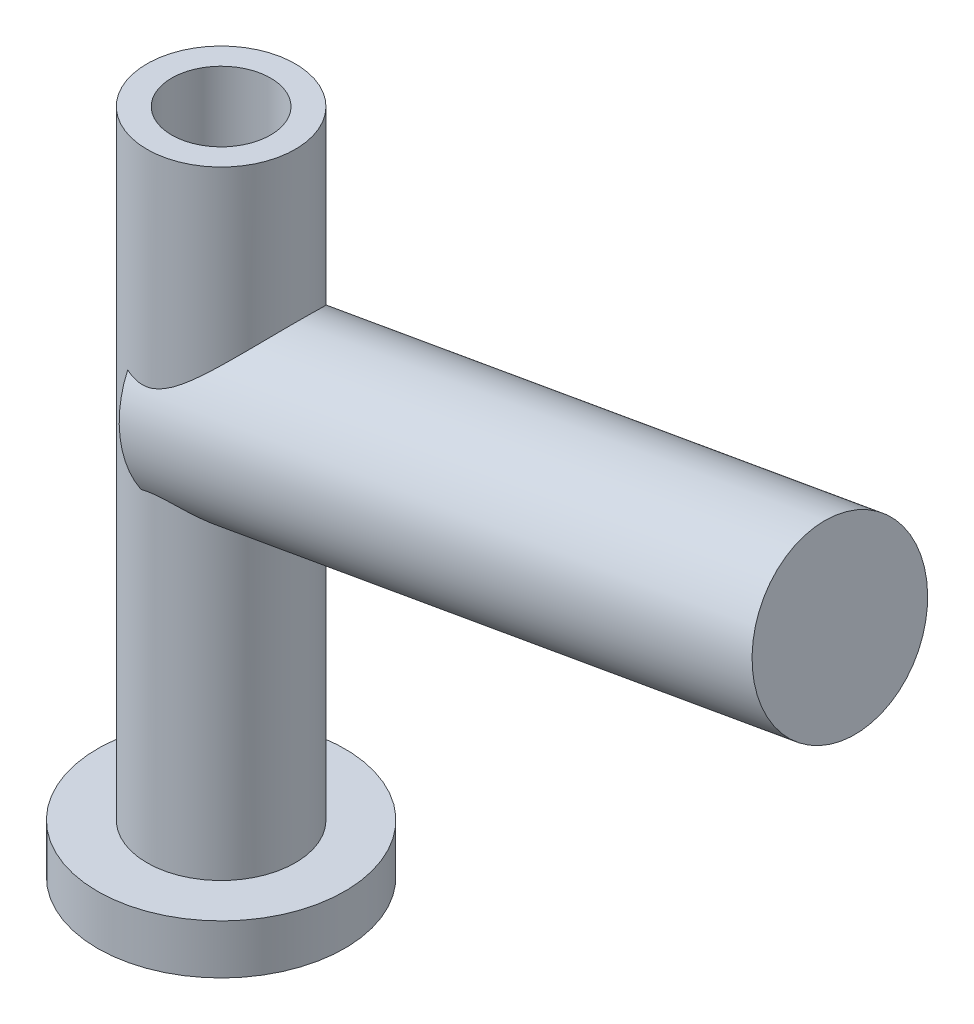
ISO-10303-21;
HEADER;
FILE_DESCRIPTION(('STEP AP214'),'2;1');
FILE_NAME('part.step','',(''),(''),'','','');
FILE_SCHEMA(('AUTOMOTIVE_DESIGN { 1 0 10303 214 1 1 1 1 }'));
ENDSEC;
DATA;
#1=APPLICATION_CONTEXT('core data for automotive mechanical design processes');
#2=APPLICATION_PROTOCOL_DEFINITION('international standard','automotive_design',2000,#1);
#3=PRODUCT_CONTEXT('',#1,'mechanical');
#4=PRODUCT('Part','Part','',(#3));
#5=PRODUCT_RELATED_PRODUCT_CATEGORY('part','',(#4));
#6=PRODUCT_DEFINITION_FORMATION('','',#4);
#7=PRODUCT_DEFINITION_CONTEXT('part definition',#1,'design');
#8=PRODUCT_DEFINITION('design','',#6,#7);
#9=PRODUCT_DEFINITION_SHAPE('','',#8);
#10=(LENGTH_UNIT() NAMED_UNIT(*) SI_UNIT(.MILLI.,.METRE.));
#11=(NAMED_UNIT(*) PLANE_ANGLE_UNIT() SI_UNIT($,.RADIAN.));
#12=(NAMED_UNIT(*) SI_UNIT($,.STERADIAN.) SOLID_ANGLE_UNIT());
#13=UNCERTAINTY_MEASURE_WITH_UNIT(LENGTH_MEASURE(1.E-05),#10,'distance_accuracy_value','');
#14=(GEOMETRIC_REPRESENTATION_CONTEXT(3) GLOBAL_UNCERTAINTY_ASSIGNED_CONTEXT((#13)) GLOBAL_UNIT_ASSIGNED_CONTEXT((#10,
#11,#12)) REPRESENTATION_CONTEXT('',''));
#15=CARTESIAN_POINT('',(0.,0.,0.));
#16=DIRECTION('',(0.,0.,1.));
#17=DIRECTION('',(1.,0.,0.));
#18=AXIS2_PLACEMENT_3D('',#15,#16,#17);
#19=CARTESIAN_POINT('',(0.,135.,0.));
#20=DIRECTION('',(0.,1.,0.));
#21=DIRECTION('',(0.,0.,1.));
#22=AXIS2_PLACEMENT_3D('',#19,#20,#21);
#23=CYLINDRICAL_SURFACE('',#22,30.);
#24=CARTESIAN_POINT('',(0.,-115.,0.));
#25=DIRECTION('',(0.,1.,0.));
#26=DIRECTION('',(0.,0.,1.));
#27=AXIS2_PLACEMENT_3D('',#24,#25,#26);
#28=CIRCLE('',#27,30.);
#29=CARTESIAN_POINT('',(0.,-115.,30.));
#30=VERTEX_POINT('',#29);
#31=EDGE_CURVE('E91',#30,#30,#28,.T.);
#32=ORIENTED_EDGE('',*,*,#31,.T.);
#33=EDGE_LOOP('',(#32));
#34=FACE_BOUND('',#33,.T.);
#35=CARTESIAN_POINT('',(0.,135.,0.));
#36=DIRECTION('',(0.,1.,0.));
#37=DIRECTION('',(0.,0.,1.));
#38=AXIS2_PLACEMENT_3D('',#35,#36,#37);
#39=CIRCLE('',#38,30.);
#40=CARTESIAN_POINT('',(0.,135.,30.));
#41=VERTEX_POINT('',#40);
#42=EDGE_CURVE('E88',#41,#41,#39,.T.);
#43=ORIENTED_EDGE('',*,*,#42,.F.);
#44=EDGE_LOOP('',(#43));
#45=FACE_BOUND('',#44,.T.);
#46=CARTESIAN_POINT('',(0.,-1.38777878078145E-13,0.));
#47=DIRECTION('',(0.984807753012208,0.17364817766693,0.));
#48=DIRECTION('',(-0.17364817766693,0.984807753012208,0.));
#49=AXIS2_PLACEMENT_3D('',#46,#47,#48);
#50=ELLIPSE('',#49,172.763114494309,30.);
#51=CARTESIAN_POINT('',(-9.23920533264166,52.3981372307256,28.5418479573638));
#52=VERTEX_POINT('',#51);
#53=CARTESIAN_POINT('',(-2.55965773767597,14.5165403921255,29.8906030763172));
#54=VERTEX_POINT('',#53);
#55=EDGE_CURVE('E11',#52,#54,#50,.T.);
#56=ORIENTED_EDGE('',*,*,#55,.F.);
#57=CARTESIAN_POINT('',(-9.23920533264166,52.3981372307256,-28.5418479573638));
#58=CARTESIAN_POINT('',(-8.76370408059712,52.2617576464605,-28.6958069958626));
#59=CARTESIAN_POINT('',(-8.28102742971508,52.1367910964455,-28.8388882610754));
#60=CARTESIAN_POINT('',(-7.30216228373933,51.9150394060665,-29.1021524387991));
#61=CARTESIAN_POINT('',(-6.80595024342463,51.8183073186031,-29.2222920992104));
#62=CARTESIAN_POINT('',(-5.80377901372995,51.659111483574,-29.4377004813719));
#63=CARTESIAN_POINT('',(-5.29784446712649,51.5965705586241,-29.5330249596164));
#64=CARTESIAN_POINT('',(-4.27872879955852,51.5106381633373,-29.6977883449844));
#65=CARTESIAN_POINT('',(-3.76555263635762,51.4872211055951,-29.7672441473649));
#66=CARTESIAN_POINT('',(-2.73014739229804,51.4832253533299,-29.8801020990964));
#67=CARTESIAN_POINT('',(-2.20788190680779,51.503139786847,-29.9231971095118));
#68=CARTESIAN_POINT('',(-1.16543790113219,51.5883452387973,-29.9819004489295));
#69=CARTESIAN_POINT('',(-0.645259677012007,51.6536424805394,-29.9975050071501));
#70=CARTESIAN_POINT('',(0.386499130689316,51.8280786591535,-30.00193702364));
#71=CARTESIAN_POINT('',(0.89809685148368,51.9371155996837,-29.9908264797481));
#72=CARTESIAN_POINT('',(1.90981806245276,52.1952559714691,-29.9434342890657));
#73=CARTESIAN_POINT('',(2.40993991222923,52.3443650925228,-29.9071490665963));
#74=CARTESIAN_POINT('',(3.50582754863397,52.7145111915876,-29.8006047991305));
#75=CARTESIAN_POINT('',(4.09810619795162,52.9441706681218,-29.7245816944905));
#76=CARTESIAN_POINT('',(5.25960318105233,53.4452224667152,-29.5412033374435));
#77=CARTESIAN_POINT('',(5.82881325386325,53.7166295748471,-29.4338369718137));
#78=CARTESIAN_POINT('',(6.94719306250328,54.293045106504,-29.1901655493377));
#79=CARTESIAN_POINT('',(7.49624375742921,54.5982202532928,-29.0537135152937));
#80=CARTESIAN_POINT('',(8.57254309884193,55.2328868977032,-28.7545392603125));
#81=CARTESIAN_POINT('',(9.09979172618215,55.5623784166786,-28.5918170163055));
#82=CARTESIAN_POINT('',(10.0805595679799,56.2040620414558,-28.2598966425323));
#83=CARTESIAN_POINT('',(10.5360553745463,56.5145058789078,-28.0931191131622));
#84=CARTESIAN_POINT('',(11.4321816067272,57.1459785272431,-27.7405317074107));
#85=CARTESIAN_POINT('',(11.8728096339986,57.4670090295177,-27.5547187797289));
#86=CARTESIAN_POINT('',(12.7404294459544,58.116706196456,-27.1644594128187));
#87=CARTESIAN_POINT('',(13.1674121687537,58.4453776951684,-26.9600009245718));
#88=CARTESIAN_POINT('',(14.0082474806452,59.1075457444559,-26.5328352558358));
#89=CARTESIAN_POINT('',(14.4221007516424,59.4410420431309,-26.3101290252399));
#90=CARTESIAN_POINT('',(15.2372739695686,60.1106334235338,-25.8465722810219));
#91=CARTESIAN_POINT('',(15.6385950140995,60.4467282744396,-25.6057233627192));
#92=CARTESIAN_POINT('',(16.4291427936178,61.1196086607614,-25.1058156781763));
#93=CARTESIAN_POINT('',(16.8183693235312,61.4563942077857,-24.8467566034085));
#94=CARTESIAN_POINT('',(17.5847644729614,62.1287623190837,-24.3103831123659));
#95=CARTESIAN_POINT('',(17.961937944134,62.4643453178602,-24.0330761823936));
#96=CARTESIAN_POINT('',(18.7043530254586,63.1327793307824,-23.459903367593));
#97=CARTESIAN_POINT('',(19.0695949721434,63.4656304217839,-23.1640380069002));
#98=CARTESIAN_POINT('',(20.0517889679512,64.3699042663142,-22.3292291528237));
#99=CARTESIAN_POINT('',(20.6566920180135,64.9370885515482,-21.7712843227377));
#100=CARTESIAN_POINT('',(21.8279561750685,66.0504173663809,-20.5968011652514));
#101=CARTESIAN_POINT('',(22.3943131562392,66.5965596410182,-19.9802565824336));
#102=CARTESIAN_POINT('',(23.4834796168731,67.6581830329136,-18.6879232909392));
#103=CARTESIAN_POINT('',(24.006377505436,68.17372575592,-18.0122608985536));
#104=CARTESIAN_POINT('',(24.754458001852,68.9175162465985,-16.9529798033321));
#105=CARTESIAN_POINT('',(24.997745839288,69.16049749248,-16.5923024464639));
#106=CARTESIAN_POINT('',(25.4714994873376,69.6354663550504,-15.8554290024083));
#107=CARTESIAN_POINT('',(25.7019623417374,69.867451435264,-15.4792293717852));
#108=CARTESIAN_POINT('',(26.2425325842484,70.4134309482777,-14.5508211020041));
#109=CARTESIAN_POINT('',(26.5456482946684,70.7211563799541,-13.9907910428415));
#110=CARTESIAN_POINT('',(27.1207835254385,71.3073307234452,-12.8404239082046));
#111=CARTESIAN_POINT('',(27.3928115422675,71.5857876328691,-12.2500951777886));
#112=CARTESIAN_POINT('',(27.9023452853012,72.1090305351109,-11.0403670648125));
#113=CARTESIAN_POINT('',(28.1398580606016,72.3538234026333,-10.4209736524539));
#114=CARTESIAN_POINT('',(28.576726849544,72.8052203237358,-9.15526184185316));
#115=CARTESIAN_POINT('',(28.7760822202951,73.0118237338829,-8.5089429901842));
#116=CARTESIAN_POINT('',(29.1348189679878,73.3843093144035,-7.18588330146767));
#117=CARTESIAN_POINT('',(29.293757363932,73.5497398326262,-6.50889380430608));
#118=CARTESIAN_POINT('',(29.5654028684659,73.8328507804401,-5.13581558407263));
#119=CARTESIAN_POINT('',(29.6781100849465,73.9505313214666,-4.43972690557707));
#120=CARTESIAN_POINT('',(29.8544348684401,74.1347691168543,-3.03530432570916));
#121=CARTESIAN_POINT('',(29.918099033566,74.2013748994735,-2.32698270347058));
#122=CARTESIAN_POINT('',(29.9948086139681,74.2816400842745,-0.904657328092884));
#123=CARTESIAN_POINT('',(30.0078620589632,74.2953078854099,-0.19065449432883));
#124=CARTESIAN_POINT('',(29.9849080222502,74.2712839176778,1.12815848437519));
#125=CARTESIAN_POINT('',(29.9559795403584,74.2410027573391,1.73325085304579));
#126=CARTESIAN_POINT('',(29.8619483833434,74.1426469691388,2.93745561826941));
#127=CARTESIAN_POINT('',(29.7968500690689,74.0745768973326,3.53656872685491));
#128=CARTESIAN_POINT('',(29.6316882116896,73.9020704542276,4.7247167630962));
#129=CARTESIAN_POINT('',(29.5316182217539,73.7976273777832,5.31374981153433));
#130=CARTESIAN_POINT('',(29.2982654383313,73.5544526642052,6.4779756155181));
#131=CARTESIAN_POINT('',(29.1649809404928,73.4157192675194,7.05316765917246));
#132=CARTESIAN_POINT('',(28.867913853102,73.107114828949,8.1843888008068));
#133=CARTESIAN_POINT('',(28.7042553791107,72.9373705478193,8.74048534317975));
#134=CARTESIAN_POINT('',(28.3483782129876,72.5691418234498,9.83360952584304));
#135=CARTESIAN_POINT('',(28.1561605553439,72.3706584212225,10.3706378559611));
#136=CARTESIAN_POINT('',(27.7454858117003,71.9478045243221,11.4239929889789));
#137=CARTESIAN_POINT('',(27.5270290115285,71.7234343116402,11.9403200173003));
#138=CARTESIAN_POINT('',(27.0660631493864,71.2515711687057,12.9513309591974));
#139=CARTESIAN_POINT('',(26.8235486504667,71.0040730123614,13.4460099438273));
#140=CARTESIAN_POINT('',(26.3711300740351,70.5441459538254,14.3089881076496));
#141=CARTESIAN_POINT('',(26.165425204,70.3356179786856,14.6815921495213));
#142=CARTESIAN_POINT('',(25.7414838124346,69.9073106013335,15.4128059398727));
#143=CARTESIAN_POINT('',(25.5232492871372,69.687532992022,15.7714179023727));
#144=CARTESIAN_POINT('',(24.8507619489904,69.0128375590382,16.8266364393156));
#145=CARTESIAN_POINT('',(24.3788390026724,68.5426730054075,17.5024107082919));
#146=CARTESIAN_POINT('',(23.3923569937546,67.5691866568175,18.8006586130222));
#147=CARTESIAN_POINT('',(22.8776651633256,67.0657626868775,19.4229530713878));
#148=CARTESIAN_POINT('',(21.8112067809069,66.0349085933306,20.6133395187483));
#149=CARTESIAN_POINT('',(21.2594433400711,65.507480485414,21.1814360465268));
#150=CARTESIAN_POINT('',(20.3161289947051,64.6189643465774,22.0799076848202));
#151=CARTESIAN_POINT('',(19.9342156007396,64.2625829990217,22.4252104393875));
#152=CARTESIAN_POINT('',(19.1560238509745,63.5445196446655,23.093501972226));
#153=CARTESIAN_POINT('',(18.7597445715273,63.1828372979337,23.4164893118448));
#154=CARTESIAN_POINT('',(17.9528911583845,62.4560241354089,24.0406742977639));
#155=CARTESIAN_POINT('',(17.5423087649533,62.0908914188519,24.3418590338842));
#156=CARTESIAN_POINT('',(16.7070716614778,61.3595019832984,24.9225291223324));
#157=CARTESIAN_POINT('',(16.2824173697978,60.9932452980114,25.2020151189499));
#158=CARTESIAN_POINT('',(15.4195220932517,60.2625302873963,25.7390001344828));
#159=CARTESIAN_POINT('',(14.981306714849,59.8980699189338,25.9965375112769));
#160=CARTESIAN_POINT('',(14.0899800326672,59.1728065282034,26.49022545663));
#161=CARTESIAN_POINT('',(13.636867765076,58.8120037445608,26.7263746376708));
#162=CARTESIAN_POINT('',(12.7153046800028,58.0973317166981,27.1768999157049));
#163=CARTESIAN_POINT('',(12.2468670428058,57.7434569122474,27.3912941038427));
#164=CARTESIAN_POINT('',(11.2932270919916,57.0459192910661,27.7980524056648));
#165=CARTESIAN_POINT('',(10.8080281098481,56.702254469977,27.9904208647461));
#166=CARTESIAN_POINT('',(9.8557853896029,56.0541916536583,28.3390413922437));
#167=CARTESIAN_POINT('',(9.39003656415458,55.7487658418672,28.4969099891686));
#168=CARTESIAN_POINT('',(8.44162839337112,55.1546114680439,28.792109245358));
#169=CARTESIAN_POINT('',(7.95896992272514,54.8658820443954,28.929440965008));
#170=CARTESIAN_POINT('',(6.97616971034796,54.3106892489379,29.182017496931));
#171=CARTESIAN_POINT('',(6.47605141083187,54.0441975360464,29.2972906721005));
#172=CARTESIAN_POINT('',(5.45695339935787,53.5393733186641,29.5040987354276));
#173=CARTESIAN_POINT('',(4.93797677704143,53.3010362284347,29.5956374922846));
#174=CARTESIAN_POINT('',(3.97145968064061,52.8974333513474,29.7392617948301));
#175=CARTESIAN_POINT('',(3.52684247239914,52.7266387013662,29.7954143315804));
#176=CARTESIAN_POINT('',(2.6255680728627,52.4137902055152,29.8883174929525));
#177=CARTESIAN_POINT('',(2.16891212387028,52.2717334071474,29.9250701113274));
#178=CARTESIAN_POINT('',(1.24627999694184,52.0207344489324,29.9776549010158));
#179=CARTESIAN_POINT('',(0.780323739601092,51.9117282272186,29.9935277456304));
#180=CARTESIAN_POINT('',(-0.158825480950692,51.7297021585302,30.0032533341429));
#181=CARTESIAN_POINT('',(-0.632017984625233,51.6566800360964,29.9971074705999));
#182=CARTESIAN_POINT('',(-1.58381587787343,51.5480869485472,29.9619626001591));
#183=CARTESIAN_POINT('',(-2.06243547166916,51.5126699163779,29.9328705046867));
#184=CARTESIAN_POINT('',(-3.01903261079771,51.4795483086646,29.8515646112694));
#185=CARTESIAN_POINT('',(-3.4970100818479,51.481847774014,29.799348336415));
#186=CARTESIAN_POINT('',(-4.44951204228964,51.5220303652133,29.6720968099138));
#187=CARTESIAN_POINT('',(-4.92402537816674,51.5599995781585,29.5970066496893));
#188=CARTESIAN_POINT('',(-5.86520057072053,51.6680181288889,29.4249604761822));
#189=CARTESIAN_POINT('',(-6.33186386720708,51.7380615158066,29.328008520711));
#190=CARTESIAN_POINT('',(-7.21097158997695,51.8978244015101,29.123626661987));
#191=CARTESIAN_POINT('',(-7.6243286157153,51.9850173182787,29.0180892631534));
#192=CARTESIAN_POINT('',(-8.43979676673845,52.1782637813755,28.7914590758404));
#193=CARTESIAN_POINT('',(-8.84195624371864,52.2842138770558,28.6704525720927));
#194=CARTESIAN_POINT('',(-9.23920533264174,52.3981372307253,28.541847957364));
#195=B_SPLINE_CURVE_WITH_KNOTS('',3,(#57,#58,#59,#60,#61,#62,#63,#64,#65,#66,#67,#68,#69,#70,
#71,#72,#73,#74,#75,#76,#77,#78,#79,#80,#81,#82,#83,#84,#85,#86,#87,#88,#89,#90,#91,#92,#93,#94,
#95,#96,#97,#98,#99,#100,#101,#102,#103,#104,#105,#106,#107,#108,#109,#110,#111,#112,#113,#114,
#115,#116,#117,#118,#119,#120,#121,#122,#123,#124,#125,#126,#127,#128,#129,#130,#131,#132,#133,
#134,#135,#136,#137,#138,#139,#140,#141,#142,#143,#144,#145,#146,#147,#148,#149,#150,#151,#152,
#153,#154,#155,#156,#157,#158,#159,#160,#161,#162,#163,#164,#165,#166,#167,#168,#169,#170,#171,
#172,#173,#174,#175,#176,#177,#178,#179,#180,#181,#182,#183,#184,#185,#186,#187,#188,#189,#190,
#191,#192,#193,#194),.UNSPECIFIED.,.F.,.F.,(4,2,2,2,2,2,2,2,2,2,2,2,2,2,2,2,2,2,2,2,2,2,2,2,2,2,
2,2,2,2,2,2,2,2,2,2,2,2,2,2,2,2,2,2,2,2,2,2,2,2,2,2,2,2,2,2,2,2,2,2,2,2,2,2,2,2,2,2,4),(0.,
1.55447151518899,3.11184537054801,4.66568920297797,6.21851640743011,7.78910768624716,
9.35991438152042,10.9270792194632,12.4944666948405,14.410705993032,16.327625549499,
18.2544716957656,20.1813195341524,21.9083922246789,23.6357421927305,25.3642164167281,
27.0926007214115,28.820833223125,30.5490950126723,32.2766521394378,34.0041604977104,
36.9998295474574,39.9958187393777,42.9855558641575,44.4800535936813,45.9748943964915,
48.0947862585342,50.2140973469949,52.3329749954628,54.4518883404662,56.5931114512204,
58.7343295649184,60.8735106884845,63.0123524032036,64.8297252116818,66.6468789544891,
68.46436785618,70.2819500387355,72.0922624314136,73.9025092658337,75.712736382662,
77.5233735400645,78.9447182678146,80.3658371710202,83.2088800653104,86.0611043147189,
88.9130894957111,90.791092805504,92.6692170755224,94.5484445109201,96.4276161260215,
98.3034332739705,100.179372024939,102.05373776214,103.927733071232,105.663702628681,
107.399582521428,109.133215195773,110.86656511088,112.30411054739,113.741508216832,
115.176101703005,116.610604460823,118.050956848,119.49146355354,120.935455803553,
122.37918025159,123.684649228814,124.983130609735),.UNSPECIFIED.);
#196=CARTESIAN_POINT('',(-9.2392053326415,52.3981372307247,-28.5418479573641));
#197=VERTEX_POINT('',#196);
#198=EDGE_CURVE('E41',#197,#52,#195,.T.);
#199=ORIENTED_EDGE('',*,*,#198,.F.);
#200=CARTESIAN_POINT('',(-2.55965773767611,14.5165403921263,-29.8906030763174));
#201=VERTEX_POINT('',#200);
#202=EDGE_CURVE('E53',#201,#197,#50,.T.);
#203=ORIENTED_EDGE('',*,*,#202,.F.);
#204=CARTESIAN_POINT('',(-2.55965773767597,14.5165403921255,29.8906030763172));
#205=CARTESIAN_POINT('',(-2.3427539216939,14.5857519527359,29.9091776512389));
#206=CARTESIAN_POINT('',(-2.12456736897643,14.6515050381398,29.9254826695435));
#207=CARTESIAN_POINT('',(-1.68579412105872,14.7756972704314,29.9534046391235));
#208=CARTESIAN_POINT('',(-1.4652070863873,14.8341353678464,29.9650209182415));
#209=CARTESIAN_POINT('',(-0.800122180655857,14.9978691687795,29.9926088052968));
#210=CARTESIAN_POINT('',(-0.352364237312896,15.0915638436468,30.001313926361));
#211=CARTESIAN_POINT('',(0.544559855381174,15.2447559866204,29.9983783919114));
#212=CARTESIAN_POINT('',(0.993673359320909,15.3045661155233,29.986927897652));
#213=CARTESIAN_POINT('',(1.89403704029464,15.3903300467163,29.9435412201925));
#214=CARTESIAN_POINT('',(2.3452866271985,15.416292708026,29.9116104006475));
#215=CARTESIAN_POINT('',(3.24759427537714,15.434980108314,29.8271515927931));
#216=CARTESIAN_POINT('',(3.69864931647272,15.4276254758363,29.7745746916922));
#217=CARTESIAN_POINT('',(4.59633390994997,15.3815487663664,29.6492694560147));
#218=CARTESIAN_POINT('',(5.0429628672266,15.3428225277345,29.5765384487121));
#219=CARTESIAN_POINT('',(5.92992396512354,15.23701833324,29.4115599717507));
#220=CARTESIAN_POINT('',(6.3702442426767,15.1698927694896,29.319279860776));
#221=CARTESIAN_POINT('',(7.24201358935993,15.0109526417831,29.116209670304));
#222=CARTESIAN_POINT('',(7.67346178179869,14.919135650454,29.0054177713495));
#223=CARTESIAN_POINT('',(8.7845266900505,14.6526771136061,28.6938574838979));
#224=CARTESIAN_POINT('',(9.45633157155359,14.4615374309692,28.4792112305831));
#225=CARTESIAN_POINT('',(10.772305747962,14.0397757734527,28.007975219263));
#226=CARTESIAN_POINT('',(11.416457450249,13.8091291169409,27.7513592456012));
#227=CARTESIAN_POINT('',(12.6788905632942,13.3195009065606,27.1978373766483));
#228=CARTESIAN_POINT('',(13.2970738885546,13.0604233151391,26.9007940555546));
#229=CARTESIAN_POINT('',(14.5054856304436,12.5242062555651,26.2689123966116));
#230=CARTESIAN_POINT('',(15.0957166182649,12.2470684542729,25.9340775446354));
#231=CARTESIAN_POINT('',(16.0621670580192,11.7736171754142,25.3419803099596));
#232=CARTESIAN_POINT('',(16.4458980310561,11.5801320807143,25.0946248511083));
#233=CARTESIAN_POINT('',(17.2007083151733,11.1903008827861,24.583397265154));
#234=CARTESIAN_POINT('',(17.5717868675422,10.9939546089894,24.3195241502392));
#235=CARTESIAN_POINT('',(18.6660966289598,10.4032012479735,23.5033066331385));
#236=CARTESIAN_POINT('',(19.3703430545543,10.0071090093243,22.9264001881551));
#237=CARTESIAN_POINT('',(20.7247899311286,9.22323453252005,21.709687373986));
#238=CARTESIAN_POINT('',(21.375070715227,8.83544060426609,21.0699777093308));
#239=CARTESIAN_POINT('',(22.6192415922098,8.07768178424954,19.7283125107002));
#240=CARTESIAN_POINT('',(23.2131476484241,7.70771186005994,19.0263747070673));
#241=CARTESIAN_POINT('',(24.2425920648422,7.05625795244183,17.6884467011288));
#242=CARTESIAN_POINT('',(24.6877838130942,6.77051285047984,17.0619395945016));
#243=CARTESIAN_POINT('',(25.5328345263627,6.22247215641562,15.7692878213314));
#244=CARTESIAN_POINT('',(25.9326972766203,5.9601746066905,15.1031464715779));
#245=CARTESIAN_POINT('',(26.6831569574514,5.46389221480821,13.7338416407556));
#246=CARTESIAN_POINT('',(27.0337707892959,5.22989766346015,13.030690975006));
#247=CARTESIAN_POINT('',(27.6818493652197,4.79467244365044,11.5904566649135));
#248=CARTESIAN_POINT('',(27.9793136768304,4.59344204178633,10.8533727445227));
#249=CARTESIAN_POINT('',(28.5190910778352,4.22658778772972,9.34391161804907));
#250=CARTESIAN_POINT('',(28.7609660457036,4.06124732868338,8.57130803483653));
#251=CARTESIAN_POINT('',(29.1828031920545,3.77194435250744,7.00173298225448));
#252=CARTESIAN_POINT('',(29.362764658364,3.64798231134219,6.20476123269987));
#253=CARTESIAN_POINT('',(29.6575019893387,3.4445546972199,4.59376297913877));
#254=CARTESIAN_POINT('',(29.7723199484644,3.36506039055063,3.7797478417049));
#255=CARTESIAN_POINT('',(29.9347495579477,3.25251262464284,2.14189475343998));
#256=CARTESIAN_POINT('',(29.9823704010116,3.21945281307087,1.31805816175783));
#257=CARTESIAN_POINT('',(30.0077643449285,3.20182761760856,-0.224929415890164));
#258=CARTESIAN_POINT('',(29.9937432387296,3.21156500700341,-0.943898027767887));
#259=CARTESIAN_POINT('',(29.9142524406049,3.26670687722589,-2.37755552613835));
#260=CARTESIAN_POINT('',(29.8487879631649,3.31210774307467,-3.09224483899836));
#261=CARTESIAN_POINT('',(29.6673872629732,3.43766587029792,-4.51202281033156));
#262=CARTESIAN_POINT('',(29.551453869319,3.51782118346786,-5.21711200466684));
#263=CARTESIAN_POINT('',(29.2707533171613,3.71133786872838,-6.6128474928464));
#264=CARTESIAN_POINT('',(29.1059849292764,3.82470007677492,-7.3034934226245));
#265=CARTESIAN_POINT('',(28.7335609598204,4.07994718764028,-8.65229326910457));
#266=CARTESIAN_POINT('',(28.5268313059953,4.22121477068751,-9.31082099009664));
#267=CARTESIAN_POINT('',(28.0709475707519,4.53125392397695,-10.6062929127117));
#268=CARTESIAN_POINT('',(27.8217946118659,4.70002476647028,-11.2432376848909));
#269=CARTESIAN_POINT('',(27.2836153930005,5.06242262085753,-12.4926799968596));
#270=CARTESIAN_POINT('',(26.9945895127262,5.25604939605006,-13.1051777693834));
#271=CARTESIAN_POINT('',(26.3792408505677,5.66531900066845,-14.303474739634));
#272=CARTESIAN_POINT('',(26.0529158938724,5.88096311378899,-14.8892723777579));
#273=CARTESIAN_POINT('',(25.3256200131977,6.35739238272442,-16.0986610825594));
#274=CARTESIAN_POINT('',(24.9203810563457,6.62051280840583,-16.7187661193766));
#275=CARTESIAN_POINT('',(24.0697663958043,7.16617177084083,-17.9217513801782));
#276=CARTESIAN_POINT('',(23.6243877514995,7.44871172990013,-18.5046288715359));
#277=CARTESIAN_POINT('',(22.6956930037856,8.02911570437703,-19.6326248288753));
#278=CARTESIAN_POINT('',(22.212328489275,8.32699910212659,-20.177693388456));
#279=CARTESIAN_POINT('',(21.2104687777821,8.93302006975829,-21.2283529998026));
#280=CARTESIAN_POINT('',(20.6919729332741,9.24115782859113,-21.7339433235526));
#281=CARTESIAN_POINT('',(19.5245860839282,9.9188929878701,-22.7929651256535));
#282=CARTESIAN_POINT('',(18.8690882249984,10.2895124935985,-23.338472812733));
#283=CARTESIAN_POINT('',(17.5129310180262,11.0285307315675,-24.3726231292356));
#284=CARTESIAN_POINT('',(16.8122560292443,11.3969286458779,-24.86124589853));
#285=CARTESIAN_POINT('',(15.7283181585323,11.9386596692353,-25.5500103790876));
#286=CARTESIAN_POINT('',(15.36159089625,12.1173927192741,-25.7721988403599));
#287=CARTESIAN_POINT('',(14.6170170616554,12.4694830381849,-26.2016702180885));
#288=CARTESIAN_POINT('',(14.239171749709,12.6428409118573,-26.4089548149749));
#289=CARTESIAN_POINT('',(13.4725168536171,12.9820535045964,-26.8081694481222));
#290=CARTESIAN_POINT('',(13.0837145461232,13.1479130212656,-27.0001093644102));
#291=CARTESIAN_POINT('',(12.2947547739346,13.4699180919552,-27.3683860624108));
#292=CARTESIAN_POINT('',(11.8945955109561,13.6260620949638,-27.5447203546861));
#293=CARTESIAN_POINT('',(11.0217377962946,13.9484896453024,-27.9065740483924));
#294=CARTESIAN_POINT('',(10.5471955670057,14.1127550650686,-28.0894729479701));
#295=CARTESIAN_POINT('',(9.58337923263324,14.4198987985192,-28.4327347079321));
#296=CARTESIAN_POINT('',(9.09411004708029,14.5627841610185,-28.5931049947285));
#297=CARTESIAN_POINT('',(8.10256871923227,14.8213559375592,-28.8897119271294));
#298=CARTESIAN_POINT('',(7.60033171649049,14.9371087252982,-29.0260072608322));
#299=CARTESIAN_POINT('',(6.58327215973054,15.1358221897542,-29.2734385441179));
#300=CARTESIAN_POINT('',(6.0684521457073,15.2187894274218,-29.3845795256138));
#301=CARTESIAN_POINT('',(5.10650500219663,15.3365129156901,-29.5656243358989));
#302=CARTESIAN_POINT('',(4.66072817048064,15.3766125691503,-29.6392057230148));
#303=CARTESIAN_POINT('',(3.76456840993173,15.4256507193605,-29.7663022500651));
#304=CARTESIAN_POINT('',(3.31418568407977,15.4345905834326,-29.8198182703955));
#305=CARTESIAN_POINT('',(2.41200664055178,15.4191973287804,-29.9063127064611));
#306=CARTESIAN_POINT('',(1.96021039973216,15.3948659887725,-29.9392922199642));
#307=CARTESIAN_POINT('',(1.05883473537726,15.3123006683051,-29.9847043628817));
#308=CARTESIAN_POINT('',(0.609254727401914,15.2540761678496,-29.9971427339751));
#309=CARTESIAN_POINT('',(-0.299369607931575,15.1021662412198,-30.0020588311389));
#310=CARTESIAN_POINT('',(-0.758232384978845,15.0073673478393,-29.9938599288145));
#311=CARTESIAN_POINT('',(-1.43949713700419,14.8408322410302,-29.9663066346198));
#312=CARTESIAN_POINT('',(-1.66530391723987,14.7812998469635,-29.9545892694805));
#313=CARTESIAN_POINT('',(-2.11440697382179,14.6545649002406,-29.9262405977777));
#314=CARTESIAN_POINT('',(-2.33770364181643,14.5873635629286,-29.9096100691712));
#315=CARTESIAN_POINT('',(-2.55965773767602,14.5165403921258,-29.8906030763174));
#316=B_SPLINE_CURVE_WITH_KNOTS('',3,(#204,#205,#206,#207,#208,#209,#210,#211,#212,#213,#214,
#215,#216,#217,#218,#219,#220,#221,#222,#223,#224,#225,#226,#227,#228,#229,#230,#231,#232,#233,
#234,#235,#236,#237,#238,#239,#240,#241,#242,#243,#244,#245,#246,#247,#248,#249,#250,#251,#252,
#253,#254,#255,#256,#257,#258,#259,#260,#261,#262,#263,#264,#265,#266,#267,#268,#269,#270,#271,
#272,#273,#274,#275,#276,#277,#278,#279,#280,#281,#282,#283,#284,#285,#286,#287,#288,#289,#290,
#291,#292,#293,#294,#295,#296,#297,#298,#299,#300,#301,#302,#303,#304,#305,#306,#307,#308,#309,
#310,#311,#312,#313,#314,#315),.UNSPECIFIED.,.F.,.F.,(4,2,2,2,2,2,2,2,2,2,2,2,2,2,2,2,2,2,2,2,2,
2,2,2,2,2,2,2,2,2,2,2,2,2,2,2,2,2,2,2,2,2,2,2,2,2,2,2,2,2,2,2,2,2,2,4),(0.,0.685227009348779,
1.37055221501416,2.74140359172476,4.09939069160047,5.4570222892148,6.81788985759076,
8.17893798313051,9.54227683172603,10.9057497569136,13.0942878866039,15.2841983065217,
17.4817480772433,19.6790953124042,21.166226904888,22.6534475180052,25.6281132712168,
28.5982684019933,31.5675799651,34.0251570410059,36.4825287431833,38.9390550519538,
41.3956013481546,43.8708911028827,46.3462093291939,48.8199262262211,51.2933046807693,
53.4481374680819,55.6027518619364,57.7572454917657,59.9117933638414,62.0231511612828,
64.1344531002951,66.2457349350109,68.3571399358699,70.7132003132999,73.0694334351678,
75.4287197367706,77.7880495355635,80.5747563573016,83.3624331976547,84.7557413731279,
86.1488922041368,87.541138674709,88.9336068401287,90.53592184654,92.1377074144273,
93.7355327009776,95.3330380731788,96.692384416658,98.0516711099397,99.4108851370488,
100.769719171051,102.173681197421,102.874969138706,103.576146096558),.UNSPECIFIED.);
#317=EDGE_CURVE('E63',#54,#201,#316,.T.);
#318=ORIENTED_EDGE('',*,*,#317,.F.);
#319=EDGE_LOOP('',(#56,#199,#203,#318));
#320=FACE_BOUND('',#319,.T.);
#321=ADVANCED_FACE('F37',(#34,#45,#320),#23,.T.);
#322=CARTESIAN_POINT('',(30.,135.,0.));
#323=DIRECTION('',(0.,-1.,0.));
#324=DIRECTION('',(0.,0.,-1.));
#325=AXIS2_PLACEMENT_3D('',#322,#323,#324);
#326=PLANE('',#325);
#327=CARTESIAN_POINT('',(0.,135.,0.));
#328=DIRECTION('',(0.,1.,0.));
#329=DIRECTION('',(0.,0.,1.));
#330=AXIS2_PLACEMENT_3D('',#327,#328,#329);
#331=CIRCLE('',#330,20.);
#332=CARTESIAN_POINT('',(0.,135.,20.));
#333=VERTEX_POINT('',#332);
#334=EDGE_CURVE('E83',#333,#333,#331,.T.);
#335=ORIENTED_EDGE('',*,*,#334,.F.);
#336=EDGE_LOOP('',(#335));
#337=FACE_BOUND('',#336,.T.);
#338=ORIENTED_EDGE('',*,*,#42,.T.);
#339=EDGE_LOOP('',(#338));
#340=FACE_BOUND('',#339,.T.);
#341=ADVANCED_FACE('F39',(#337,#340),#326,.F.);
#342=CARTESIAN_POINT('',(0.,-135.,0.));
#343=DIRECTION('',(0.,1.,0.));
#344=DIRECTION('',(0.,0.,1.));
#345=AXIS2_PLACEMENT_3D('',#342,#343,#344);
#346=PLANE('',#345);
#347=CARTESIAN_POINT('',(0.,-135.,0.));
#348=DIRECTION('',(0.,1.,0.));
#349=DIRECTION('',(0.,0.,1.));
#350=AXIS2_PLACEMENT_3D('',#347,#348,#349);
#351=CIRCLE('',#350,20.);
#352=CARTESIAN_POINT('',(0.,-135.,20.));
#353=VERTEX_POINT('',#352);
#354=EDGE_CURVE('E79',#353,#353,#351,.T.);
#355=ORIENTED_EDGE('',*,*,#354,.T.);
#356=EDGE_LOOP('',(#355));
#357=FACE_BOUND('',#356,.T.);
#358=CARTESIAN_POINT('',(0.,-135.,0.));
#359=DIRECTION('',(0.,1.,0.));
#360=DIRECTION('',(0.,0.,1.));
#361=AXIS2_PLACEMENT_3D('',#358,#359,#360);
#362=CIRCLE('',#361,50.);
#363=CARTESIAN_POINT('',(0.,-135.,50.));
#364=VERTEX_POINT('',#363);
#365=EDGE_CURVE('E76',#364,#364,#362,.T.);
#366=ORIENTED_EDGE('',*,*,#365,.F.);
#367=EDGE_LOOP('',(#366));
#368=FACE_BOUND('',#367,.T.);
#369=ADVANCED_FACE('F129',(#357,#368),#346,.F.);
#370=CARTESIAN_POINT('',(0.,135.,0.));
#371=DIRECTION('',(0.,1.,0.));
#372=DIRECTION('',(0.,0.,1.));
#373=AXIS2_PLACEMENT_3D('',#370,#371,#372);
#374=CYLINDRICAL_SURFACE('',#373,50.);
#375=CARTESIAN_POINT('',(0.,-115.,0.));
#376=DIRECTION('',(0.,1.,0.));
#377=DIRECTION('',(0.,0.,1.));
#378=AXIS2_PLACEMENT_3D('',#375,#376,#377);
#379=CIRCLE('',#378,50.);
#380=CARTESIAN_POINT('',(0.,-115.,50.));
#381=VERTEX_POINT('',#380);
#382=EDGE_CURVE('E94',#381,#381,#379,.T.);
#383=ORIENTED_EDGE('',*,*,#382,.F.);
#384=EDGE_LOOP('',(#383));
#385=FACE_BOUND('',#384,.T.);
#386=ORIENTED_EDGE('',*,*,#365,.T.);
#387=EDGE_LOOP('',(#386));
#388=FACE_BOUND('',#387,.T.);
#389=ADVANCED_FACE('F138',(#385,#388),#374,.T.);
#390=CARTESIAN_POINT('',(50.,-115.,0.));
#391=DIRECTION('',(0.,-1.,0.));
#392=DIRECTION('',(0.,0.,-1.));
#393=AXIS2_PLACEMENT_3D('',#390,#391,#392);
#394=PLANE('',#393);
#395=ORIENTED_EDGE('',*,*,#31,.F.);
#396=EDGE_LOOP('',(#395));
#397=FACE_BOUND('',#396,.T.);
#398=ORIENTED_EDGE('',*,*,#382,.T.);
#399=EDGE_LOOP('',(#398));
#400=FACE_BOUND('',#399,.T.);
#401=ADVANCED_FACE('F108',(#397,#400),#394,.F.);
#402=CARTESIAN_POINT('',(250.328473875385,77.5970027952299,0.));
#403=DIRECTION('',(-0.984807753012208,-0.17364817766693,0.));
#404=DIRECTION('',(0.17364817766693,-0.984807753012208,0.));
#405=AXIS2_PLACEMENT_3D('',#402,#403,#404);
#406=CYLINDRICAL_SURFACE('',#405,35.);
#407=CARTESIAN_POINT('',(250.328473875385,77.5970027952299,0.));
#408=DIRECTION('',(0.984807753012208,0.17364817766693,0.));
#409=DIRECTION('',(-0.17364817766693,0.984807753012208,0.));
#410=AXIS2_PLACEMENT_3D('',#407,#408,#409);
#411=CIRCLE('',#410,35.);
#412=CARTESIAN_POINT('',(244.250787657042,112.065274150657,0.));
#413=VERTEX_POINT('',#412);
#414=EDGE_CURVE('E81',#413,#413,#411,.T.);
#415=ORIENTED_EDGE('',*,*,#414,.F.);
#416=EDGE_LOOP('',(#415));
#417=FACE_BOUND('',#416,.T.);
#418=CARTESIAN_POINT('',(-5.72154190778961,32.448476601828,0.));
#419=DIRECTION('',(0.984807753012208,0.17364817766693,0.));
#420=DIRECTION('',(-0.17364817766693,0.984807753012208,0.));
#421=AXIS2_PLACEMENT_3D('',#418,#419,#420);
#422=CIRCLE('',#421,35.);
#423=EDGE_CURVE('E75',#201,#197,#422,.T.);
#424=ORIENTED_EDGE('',*,*,#423,.T.);
#425=ORIENTED_EDGE('',*,*,#198,.T.);
#426=EDGE_CURVE('E78',#52,#54,#422,.T.);
#427=ORIENTED_EDGE('',*,*,#426,.T.);
#428=ORIENTED_EDGE('',*,*,#317,.T.);
#429=EDGE_LOOP('',(#424,#425,#427,#428));
#430=FACE_BOUND('',#429,.T.);
#431=ADVANCED_FACE('F77',(#417,#430),#406,.T.);
#432=CARTESIAN_POINT('',(-5.72154190778961,32.448476601828,0.));
#433=DIRECTION('',(0.984807753012208,0.17364817766693,0.));
#434=DIRECTION('',(-0.17364817766693,0.984807753012208,0.));
#435=AXIS2_PLACEMENT_3D('',#432,#433,#434);
#436=PLANE('',#435);
#437=ORIENTED_EDGE('',*,*,#426,.F.);
#438=ORIENTED_EDGE('',*,*,#55,.T.);
#439=EDGE_LOOP('',(#437,#438));
#440=FACE_BOUND('',#439,.T.);
#441=ADVANCED_FACE('F107',(#440),#436,.F.);
#442=CARTESIAN_POINT('',(250.328473875385,77.5970027952299,0.));
#443=DIRECTION('',(0.984807753012208,0.17364817766693,0.));
#444=DIRECTION('',(-0.17364817766693,0.984807753012208,0.));
#445=AXIS2_PLACEMENT_3D('',#442,#443,#444);
#446=PLANE('',#445);
#447=ORIENTED_EDGE('',*,*,#414,.T.);
#448=EDGE_LOOP('',(#447));
#449=FACE_BOUND('',#448,.T.);
#450=ADVANCED_FACE('F114',(#449),#446,.T.);
#451=ORIENTED_EDGE('',*,*,#423,.F.);
#452=ORIENTED_EDGE('',*,*,#202,.T.);
#453=EDGE_LOOP('',(#451,#452));
#454=FACE_BOUND('',#453,.T.);
#455=ADVANCED_FACE('F74',(#454),#436,.F.);
#456=CARTESIAN_POINT('',(0.,-135.,0.));
#457=DIRECTION('',(0.,1.,0.));
#458=DIRECTION('',(0.,0.,1.));
#459=AXIS2_PLACEMENT_3D('',#456,#457,#458);
#460=CYLINDRICAL_SURFACE('',#459,20.);
#461=ORIENTED_EDGE('',*,*,#354,.F.);
#462=EDGE_LOOP('',(#461));
#463=FACE_BOUND('',#462,.T.);
#464=ORIENTED_EDGE('',*,*,#334,.T.);
#465=EDGE_LOOP('',(#464));
#466=FACE_BOUND('',#465,.T.);
#467=ADVANCED_FACE('F113',(#463,#466),#460,.F.);
#468=CLOSED_SHELL('',(#321,#341,#369,#389,#401,#431,#441,#450,#455,#467));
#469=MANIFOLD_SOLID_BREP('B2',#468);
#470=ADVANCED_BREP_SHAPE_REPRESENTATION('',(#18,#469),#14);
#471=SHAPE_DEFINITION_REPRESENTATION(#9,#470);
ENDSEC;
END-ISO-10303-21;
